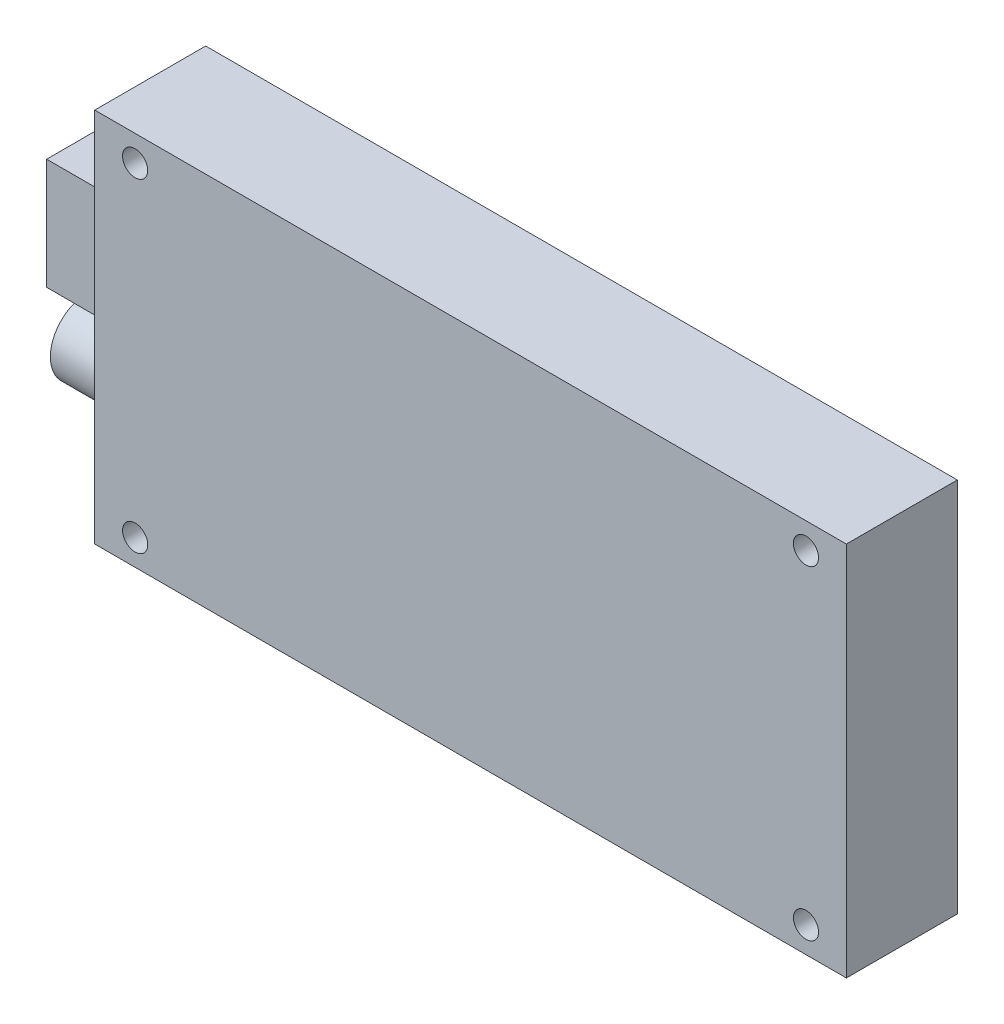
ISO-10303-21;
HEADER;
FILE_DESCRIPTION(('STEP AP214'),'2;1');
FILE_NAME('part.step','',(''),(''),'','','');
FILE_SCHEMA(('AUTOMOTIVE_DESIGN { 1 0 10303 214 1 1 1 1 }'));
ENDSEC;
DATA;
#1=APPLICATION_CONTEXT('core data for automotive mechanical design processes');
#2=APPLICATION_PROTOCOL_DEFINITION('international standard','automotive_design',2000,#1);
#3=PRODUCT_CONTEXT('',#1,'mechanical');
#4=PRODUCT('Part','Part','',(#3));
#5=PRODUCT_RELATED_PRODUCT_CATEGORY('part','',(#4));
#6=PRODUCT_DEFINITION_FORMATION('','',#4);
#7=PRODUCT_DEFINITION_CONTEXT('part definition',#1,'design');
#8=PRODUCT_DEFINITION('design','',#6,#7);
#9=PRODUCT_DEFINITION_SHAPE('','',#8);
#10=(LENGTH_UNIT() NAMED_UNIT(*) SI_UNIT(.MILLI.,.METRE.));
#11=(NAMED_UNIT(*) PLANE_ANGLE_UNIT() SI_UNIT($,.RADIAN.));
#12=(NAMED_UNIT(*) SI_UNIT($,.STERADIAN.) SOLID_ANGLE_UNIT());
#13=UNCERTAINTY_MEASURE_WITH_UNIT(LENGTH_MEASURE(1.E-05),#10,'distance_accuracy_value','');
#14=(GEOMETRIC_REPRESENTATION_CONTEXT(3) GLOBAL_UNCERTAINTY_ASSIGNED_CONTEXT((#13)) GLOBAL_UNIT_ASSIGNED_CONTEXT((#10,
#11,#12)) REPRESENTATION_CONTEXT('',''));
#15=CARTESIAN_POINT('',(0.,0.,0.));
#16=DIRECTION('',(0.,0.,1.));
#17=DIRECTION('',(1.,0.,0.));
#18=AXIS2_PLACEMENT_3D('',#15,#16,#17);
#19=CARTESIAN_POINT('',(-50.8,-2.1,11.5));
#20=DIRECTION('',(0.,0.,1.));
#21=DIRECTION('',(0.,-1.,0.));
#22=AXIS2_PLACEMENT_3D('',#19,#20,#21);
#23=PLANE('',#22);
#24=DIRECTION('',(0.,-1.,0.));
#25=VECTOR('',#24,1.);
#26=CARTESIAN_POINT('',(-50.8,11.65,11.5));
#27=LINE('',#26,#25);
#28=CARTESIAN_POINT('',(-50.8,12.9,11.5));
#29=VERTEX_POINT('',#28);
#30=CARTESIAN_POINT('',(-50.8,-2.1,11.5));
#31=VERTEX_POINT('',#30);
#32=EDGE_CURVE('E33',#29,#31,#27,.T.);
#33=ORIENTED_EDGE('',*,*,#32,.F.);
#34=DIRECTION('',(-1.,0.,0.));
#35=VECTOR('',#34,1.);
#36=CARTESIAN_POINT('',(-50.8,12.9,11.5));
#37=LINE('',#36,#35);
#38=CARTESIAN_POINT('',(-60.8,12.9,11.5));
#39=VERTEX_POINT('',#38);
#40=EDGE_CURVE('E9',#29,#39,#37,.T.);
#41=ORIENTED_EDGE('',*,*,#40,.T.);
#42=DIRECTION('',(0.,1.,0.));
#43=VECTOR('',#42,1.);
#44=CARTESIAN_POINT('',(-60.8,12.9,11.5));
#45=LINE('',#44,#43);
#46=CARTESIAN_POINT('',(-60.8,-2.1,11.5));
#47=VERTEX_POINT('',#46);
#48=EDGE_CURVE('E159',#47,#39,#45,.T.);
#49=ORIENTED_EDGE('',*,*,#48,.F.);
#50=DIRECTION('',(-1.,0.,0.));
#51=VECTOR('',#50,1.);
#52=CARTESIAN_POINT('',(-50.8,-2.1,11.5));
#53=LINE('',#52,#51);
#54=EDGE_CURVE('E25',#31,#47,#53,.T.);
#55=ORIENTED_EDGE('',*,*,#54,.F.);
#56=EDGE_LOOP('',(#33,#41,#49,#55));
#57=FACE_BOUND('',#56,.T.);
#58=ADVANCED_FACE('F15',(#57),#23,.T.);
#59=CARTESIAN_POINT('',(-50.8,-2.1,-3.49999999999999));
#60=DIRECTION('',(0.,-1.,0.));
#61=DIRECTION('',(0.,0.,-1.));
#62=AXIS2_PLACEMENT_3D('',#59,#60,#61);
#63=PLANE('',#62);
#64=DIRECTION('',(0.,0.,-1.));
#65=VECTOR('',#64,1.);
#66=CARTESIAN_POINT('',(-50.8,-2.1,-1.75));
#67=LINE('',#66,#65);
#68=CARTESIAN_POINT('',(-50.8,-2.1,0.));
#69=VERTEX_POINT('',#68);
#70=EDGE_CURVE('E122',#31,#69,#67,.T.);
#71=ORIENTED_EDGE('',*,*,#70,.F.);
#72=ORIENTED_EDGE('',*,*,#54,.T.);
#73=DIRECTION('',(0.,0.,1.));
#74=VECTOR('',#73,1.);
#75=CARTESIAN_POINT('',(-60.8,-2.1,11.5));
#76=LINE('',#75,#74);
#77=CARTESIAN_POINT('',(-60.8,-2.1,-3.49999999999999));
#78=VERTEX_POINT('',#77);
#79=EDGE_CURVE('E162',#78,#47,#76,.T.);
#80=ORIENTED_EDGE('',*,*,#79,.F.);
#81=DIRECTION('',(-1.,0.,0.));
#82=VECTOR('',#81,1.);
#83=CARTESIAN_POINT('',(-50.8,-2.1,-3.49999999999999));
#84=LINE('',#83,#82);
#85=CARTESIAN_POINT('',(-50.8,-2.1,-3.49999999999999));
#86=VERTEX_POINT('',#85);
#87=EDGE_CURVE('E386',#86,#78,#84,.T.);
#88=ORIENTED_EDGE('',*,*,#87,.F.);
#89=DIRECTION('',(0.,0.,-1.));
#90=VECTOR('',#89,1.);
#91=CARTESIAN_POINT('',(-50.8,-2.1,11.5));
#92=LINE('',#91,#90);
#93=EDGE_CURVE('E160',#69,#86,#92,.T.);
#94=ORIENTED_EDGE('',*,*,#93,.F.);
#95=EDGE_LOOP('',(#71,#72,#80,#88,#94));
#96=FACE_BOUND('',#95,.T.);
#97=ADVANCED_FACE('F207',(#96),#63,.T.);
#98=CARTESIAN_POINT('',(-50.8,12.9,-3.5));
#99=DIRECTION('',(0.,0.,-1.));
#100=DIRECTION('',(0.,1.,0.));
#101=AXIS2_PLACEMENT_3D('',#98,#99,#100);
#102=PLANE('',#101);
#103=DIRECTION('',(0.,1.,0.));
#104=VECTOR('',#103,1.);
#105=CARTESIAN_POINT('',(-50.8,-2.1,-3.49999999999999));
#106=LINE('',#105,#104);
#107=CARTESIAN_POINT('',(-50.8,12.9,-3.5));
#108=VERTEX_POINT('',#107);
#109=EDGE_CURVE('E164',#86,#108,#106,.T.);
#110=ORIENTED_EDGE('',*,*,#109,.F.);
#111=ORIENTED_EDGE('',*,*,#87,.T.);
#112=DIRECTION('',(0.,-1.,0.));
#113=VECTOR('',#112,1.);
#114=CARTESIAN_POINT('',(-60.8,-2.1,-3.49999999999999));
#115=LINE('',#114,#113);
#116=CARTESIAN_POINT('',(-60.8,12.9,-3.5));
#117=VERTEX_POINT('',#116);
#118=EDGE_CURVE('E383',#117,#78,#115,.T.);
#119=ORIENTED_EDGE('',*,*,#118,.F.);
#120=DIRECTION('',(-1.,0.,0.));
#121=VECTOR('',#120,1.);
#122=CARTESIAN_POINT('',(-50.8,12.9,-3.5));
#123=LINE('',#122,#121);
#124=EDGE_CURVE('E385',#108,#117,#123,.T.);
#125=ORIENTED_EDGE('',*,*,#124,.F.);
#126=EDGE_LOOP('',(#110,#111,#119,#125));
#127=FACE_BOUND('',#126,.T.);
#128=ADVANCED_FACE('F212',(#127),#102,.T.);
#129=CARTESIAN_POINT('',(-50.8,12.9,11.5));
#130=DIRECTION('',(0.,1.,0.));
#131=DIRECTION('',(0.,0.,1.));
#132=AXIS2_PLACEMENT_3D('',#129,#130,#131);
#133=PLANE('',#132);
#134=DIRECTION('',(0.,0.,1.));
#135=VECTOR('',#134,1.);
#136=CARTESIAN_POINT('',(-50.8,12.9,-3.5));
#137=LINE('',#136,#135);
#138=CARTESIAN_POINT('',(-50.8,12.9,0.));
#139=VERTEX_POINT('',#138);
#140=EDGE_CURVE('E172',#108,#139,#137,.T.);
#141=ORIENTED_EDGE('',*,*,#140,.F.);
#142=ORIENTED_EDGE('',*,*,#124,.T.);
#143=DIRECTION('',(0.,0.,-1.));
#144=VECTOR('',#143,1.);
#145=CARTESIAN_POINT('',(-60.8,12.9,-3.5));
#146=LINE('',#145,#144);
#147=EDGE_CURVE('E381',#39,#117,#146,.T.);
#148=ORIENTED_EDGE('',*,*,#147,.F.);
#149=ORIENTED_EDGE('',*,*,#40,.F.);
#150=DIRECTION('',(0.,0.,1.));
#151=VECTOR('',#150,1.);
#152=CARTESIAN_POINT('',(-50.8,12.9,5.75));
#153=LINE('',#152,#151);
#154=EDGE_CURVE('E135',#139,#29,#153,.T.);
#155=ORIENTED_EDGE('',*,*,#154,.F.);
#156=EDGE_LOOP('',(#141,#142,#148,#149,#155));
#157=FACE_BOUND('',#156,.T.);
#158=ADVANCED_FACE('F218',(#157),#133,.T.);
#159=CARTESIAN_POINT('',(-60.8,5.4,4.));
#160=DIRECTION('',(1.,0.,0.));
#161=DIRECTION('',(0.,0.,-1.));
#162=AXIS2_PLACEMENT_3D('',#159,#160,#161);
#163=PLANE('',#162);
#164=ORIENTED_EDGE('',*,*,#147,.T.);
#165=ORIENTED_EDGE('',*,*,#118,.T.);
#166=ORIENTED_EDGE('',*,*,#79,.T.);
#167=ORIENTED_EDGE('',*,*,#48,.T.);
#168=EDGE_LOOP('',(#164,#165,#166,#167));
#169=FACE_BOUND('',#168,.T.);
#170=ADVANCED_FACE('F222',(#169),#163,.F.);
#171=CARTESIAN_POINT('',(-50.8,5.4,4.));
#172=DIRECTION('',(1.,0.,0.));
#173=DIRECTION('',(0.,0.,-1.));
#174=AXIS2_PLACEMENT_3D('',#171,#172,#173);
#175=PLANE('',#174);
#176=DIRECTION('',(0.,-1.,0.));
#177=VECTOR('',#176,1.);
#178=CARTESIAN_POINT('',(-50.8,25.4,0.));
#179=LINE('',#178,#177);
#180=EDGE_CURVE('E156',#139,#69,#179,.T.);
#181=ORIENTED_EDGE('',*,*,#180,.T.);
#182=ORIENTED_EDGE('',*,*,#93,.T.);
#183=ORIENTED_EDGE('',*,*,#109,.T.);
#184=ORIENTED_EDGE('',*,*,#140,.T.);
#185=EDGE_LOOP('',(#181,#182,#183,#184));
#186=FACE_BOUND('',#185,.T.);
#187=ADVANCED_FACE('F226',(#186),#175,.T.);
#188=CARTESIAN_POINT('',(-50.8,-10.5,6.));
#189=DIRECTION('',(-1.,0.,0.));
#190=DIRECTION('',(0.,0.,1.));
#191=AXIS2_PLACEMENT_3D('',#188,#189,#190);
#192=CYLINDRICAL_SURFACE('',#191,5.);
#193=CARTESIAN_POINT('',(-60.8,-10.5,6.));
#194=DIRECTION('',(-1.,0.,0.));
#195=DIRECTION('',(0.,0.,1.));
#196=AXIS2_PLACEMENT_3D('',#193,#194,#195);
#197=CIRCLE('',#196,5.);
#198=CARTESIAN_POINT('',(-60.8,-10.5,11.));
#199=VERTEX_POINT('',#198);
#200=EDGE_CURVE('E169',#199,#199,#197,.T.);
#201=ORIENTED_EDGE('',*,*,#200,.F.);
#202=EDGE_LOOP('',(#201));
#203=FACE_BOUND('',#202,.T.);
#204=CARTESIAN_POINT('',(-50.8,-10.5,6.));
#205=DIRECTION('',(1.,0.,0.));
#206=DIRECTION('',(0.,1.,0.));
#207=AXIS2_PLACEMENT_3D('',#204,#205,#206);
#208=CIRCLE('',#207,5.);
#209=CARTESIAN_POINT('',(-50.8,-5.5,6.));
#210=VERTEX_POINT('',#209);
#211=EDGE_CURVE('E138',#210,#210,#208,.T.);
#212=ORIENTED_EDGE('',*,*,#211,.F.);
#213=EDGE_LOOP('',(#212));
#214=FACE_BOUND('',#213,.T.);
#215=ADVANCED_FACE('F17',(#203,#214),#192,.T.);
#216=CARTESIAN_POINT('',(-60.8,-10.5,6.));
#217=DIRECTION('',(1.,0.,0.));
#218=DIRECTION('',(0.,0.,-1.));
#219=AXIS2_PLACEMENT_3D('',#216,#217,#218);
#220=PLANE('',#219);
#221=ORIENTED_EDGE('',*,*,#200,.T.);
#222=EDGE_LOOP('',(#221));
#223=FACE_BOUND('',#222,.T.);
#224=ADVANCED_FACE('F230',(#223),#220,.F.);
#225=CARTESIAN_POINT('',(45.339,-21.9075,-99.5783574677173));
#226=DIRECTION('',(0.,0.,1.));
#227=DIRECTION('',(1.,0.,0.));
#228=AXIS2_PLACEMENT_3D('',#225,#226,#227);
#229=CYLINDRICAL_SURFACE('',#228,1.7);
#230=CARTESIAN_POINT('',(45.339,-21.9075,0.));
#231=DIRECTION('',(0.,0.,1.));
#232=DIRECTION('',(1.,0.,0.));
#233=AXIS2_PLACEMENT_3D('',#230,#231,#232);
#234=CIRCLE('',#233,1.7);
#235=CARTESIAN_POINT('',(47.039,-21.9075,0.));
#236=VERTEX_POINT('',#235);
#237=EDGE_CURVE('E127',#236,#236,#234,.T.);
#238=ORIENTED_EDGE('',*,*,#237,.F.);
#239=EDGE_LOOP('',(#238));
#240=FACE_BOUND('',#239,.T.);
#241=CARTESIAN_POINT('',(45.339,-21.9075,15.));
#242=DIRECTION('',(0.,0.,-1.));
#243=DIRECTION('',(0.,-1.,0.));
#244=AXIS2_PLACEMENT_3D('',#241,#242,#243);
#245=CIRCLE('',#244,1.7);
#246=CARTESIAN_POINT('',(45.339,-23.6075,15.));
#247=VERTEX_POINT('',#246);
#248=EDGE_CURVE('E102',#247,#247,#245,.T.);
#249=ORIENTED_EDGE('',*,*,#248,.F.);
#250=EDGE_LOOP('',(#249));
#251=FACE_BOUND('',#250,.T.);
#252=ADVANCED_FACE('F233',(#240,#251),#229,.F.);
#253=CARTESIAN_POINT('',(-45.339,21.9075,-99.5783574677173));
#254=DIRECTION('',(0.,0.,1.));
#255=DIRECTION('',(1.,0.,0.));
#256=AXIS2_PLACEMENT_3D('',#253,#254,#255);
#257=CYLINDRICAL_SURFACE('',#256,1.7);
#258=CARTESIAN_POINT('',(-45.339,21.9075,0.));
#259=DIRECTION('',(0.,0.,1.));
#260=DIRECTION('',(1.,0.,0.));
#261=AXIS2_PLACEMENT_3D('',#258,#259,#260);
#262=CIRCLE('',#261,1.7);
#263=CARTESIAN_POINT('',(-43.639,21.9075,0.));
#264=VERTEX_POINT('',#263);
#265=EDGE_CURVE('E177',#264,#264,#262,.T.);
#266=ORIENTED_EDGE('',*,*,#265,.F.);
#267=EDGE_LOOP('',(#266));
#268=FACE_BOUND('',#267,.T.);
#269=CARTESIAN_POINT('',(-45.339,21.9075,15.));
#270=DIRECTION('',(0.,0.,-1.));
#271=DIRECTION('',(0.,-1.,0.));
#272=AXIS2_PLACEMENT_3D('',#269,#270,#271);
#273=CIRCLE('',#272,1.7);
#274=CARTESIAN_POINT('',(-45.339,20.2075,15.));
#275=VERTEX_POINT('',#274);
#276=EDGE_CURVE('E114',#275,#275,#273,.T.);
#277=ORIENTED_EDGE('',*,*,#276,.F.);
#278=EDGE_LOOP('',(#277));
#279=FACE_BOUND('',#278,.T.);
#280=ADVANCED_FACE('F203',(#268,#279),#257,.F.);
#281=CARTESIAN_POINT('',(45.339,21.9075,-99.5783574677173));
#282=DIRECTION('',(0.,0.,1.));
#283=DIRECTION('',(1.,0.,0.));
#284=AXIS2_PLACEMENT_3D('',#281,#282,#283);
#285=CYLINDRICAL_SURFACE('',#284,1.7);
#286=CARTESIAN_POINT('',(45.339,21.9075,0.));
#287=DIRECTION('',(0.,0.,1.));
#288=DIRECTION('',(1.,0.,0.));
#289=AXIS2_PLACEMENT_3D('',#286,#287,#288);
#290=CIRCLE('',#289,1.7);
#291=CARTESIAN_POINT('',(47.039,21.9075,0.));
#292=VERTEX_POINT('',#291);
#293=EDGE_CURVE('E182',#292,#292,#290,.T.);
#294=ORIENTED_EDGE('',*,*,#293,.F.);
#295=EDGE_LOOP('',(#294));
#296=FACE_BOUND('',#295,.T.);
#297=CARTESIAN_POINT('',(45.339,21.9075,15.));
#298=DIRECTION('',(0.,0.,-1.));
#299=DIRECTION('',(0.,-1.,0.));
#300=AXIS2_PLACEMENT_3D('',#297,#298,#299);
#301=CIRCLE('',#300,1.7);
#302=CARTESIAN_POINT('',(45.339,20.2075,15.));
#303=VERTEX_POINT('',#302);
#304=EDGE_CURVE('E109',#303,#303,#301,.T.);
#305=ORIENTED_EDGE('',*,*,#304,.F.);
#306=EDGE_LOOP('',(#305));
#307=FACE_BOUND('',#306,.T.);
#308=ADVANCED_FACE('F195',(#296,#307),#285,.F.);
#309=CARTESIAN_POINT('',(-45.339,-21.9075,-99.5783574677173));
#310=DIRECTION('',(0.,0.,1.));
#311=DIRECTION('',(1.,0.,0.));
#312=AXIS2_PLACEMENT_3D('',#309,#310,#311);
#313=CYLINDRICAL_SURFACE('',#312,1.7);
#314=CARTESIAN_POINT('',(-45.339,-21.9075,0.));
#315=DIRECTION('',(0.,0.,1.));
#316=DIRECTION('',(1.,0.,0.));
#317=AXIS2_PLACEMENT_3D('',#314,#315,#316);
#318=CIRCLE('',#317,1.7);
#319=CARTESIAN_POINT('',(-43.639,-21.9075,0.));
#320=VERTEX_POINT('',#319);
#321=EDGE_CURVE('E118',#320,#320,#318,.T.);
#322=ORIENTED_EDGE('',*,*,#321,.F.);
#323=EDGE_LOOP('',(#322));
#324=FACE_BOUND('',#323,.T.);
#325=CARTESIAN_POINT('',(-45.339,-21.9075,15.));
#326=DIRECTION('',(0.,0.,-1.));
#327=DIRECTION('',(0.,-1.,0.));
#328=AXIS2_PLACEMENT_3D('',#325,#326,#327);
#329=CIRCLE('',#328,1.7);
#330=CARTESIAN_POINT('',(-45.339,-23.6075,15.));
#331=VERTEX_POINT('',#330);
#332=EDGE_CURVE('E107',#331,#331,#329,.T.);
#333=ORIENTED_EDGE('',*,*,#332,.F.);
#334=EDGE_LOOP('',(#333));
#335=FACE_BOUND('',#334,.T.);
#336=ADVANCED_FACE('F192',(#324,#335),#313,.F.);
#337=CARTESIAN_POINT('',(-50.8,25.4,0.));
#338=DIRECTION('',(-1.,0.,0.));
#339=DIRECTION('',(0.,0.,1.));
#340=AXIS2_PLACEMENT_3D('',#337,#338,#339);
#341=PLANE('',#340);
#342=ORIENTED_EDGE('',*,*,#70,.T.);
#343=DIRECTION('',(0.,-1.,0.));
#344=VECTOR('',#343,1.);
#345=CARTESIAN_POINT('',(-50.8,25.4,0.));
#346=LINE('',#345,#344);
#347=CARTESIAN_POINT('',(-50.8,-25.4,0.));
#348=VERTEX_POINT('',#347);
#349=EDGE_CURVE('E119',#69,#348,#346,.T.);
#350=ORIENTED_EDGE('',*,*,#349,.T.);
#351=DIRECTION('',(0.,0.,1.));
#352=VECTOR('',#351,1.);
#353=CARTESIAN_POINT('',(-50.8,-25.4,0.));
#354=LINE('',#353,#352);
#355=CARTESIAN_POINT('',(-50.8,-25.4,15.));
#356=VERTEX_POINT('',#355);
#357=EDGE_CURVE('E123',#348,#356,#354,.T.);
#358=ORIENTED_EDGE('',*,*,#357,.T.);
#359=DIRECTION('',(0.,-1.,0.));
#360=VECTOR('',#359,1.);
#361=CARTESIAN_POINT('',(-50.8,25.4,15.));
#362=LINE('',#361,#360);
#363=CARTESIAN_POINT('',(-50.8,25.4,15.));
#364=VERTEX_POINT('',#363);
#365=EDGE_CURVE('E105',#364,#356,#362,.T.);
#366=ORIENTED_EDGE('',*,*,#365,.F.);
#367=DIRECTION('',(0.,0.,1.));
#368=VECTOR('',#367,1.);
#369=CARTESIAN_POINT('',(-50.8,25.4,0.));
#370=LINE('',#369,#368);
#371=CARTESIAN_POINT('',(-50.8,25.4,0.));
#372=VERTEX_POINT('',#371);
#373=EDGE_CURVE('E128',#372,#364,#370,.T.);
#374=ORIENTED_EDGE('',*,*,#373,.F.);
#375=DIRECTION('',(0.,-1.,0.));
#376=VECTOR('',#375,1.);
#377=CARTESIAN_POINT('',(-50.8,25.4,0.));
#378=LINE('',#377,#376);
#379=EDGE_CURVE('E125',#372,#139,#378,.T.);
#380=ORIENTED_EDGE('',*,*,#379,.T.);
#381=ORIENTED_EDGE('',*,*,#154,.T.);
#382=ORIENTED_EDGE('',*,*,#32,.T.);
#383=EDGE_LOOP('',(#342,#350,#358,#366,#374,#380,#381,#382));
#384=FACE_BOUND('',#383,.T.);
#385=ORIENTED_EDGE('',*,*,#211,.T.);
#386=EDGE_LOOP('',(#385));
#387=FACE_BOUND('',#386,.T.);
#388=ADVANCED_FACE('F150',(#384,#387),#341,.T.);
#389=CARTESIAN_POINT('',(50.8,25.4,0.));
#390=DIRECTION('',(0.,1.,0.));
#391=DIRECTION('',(0.,0.,1.));
#392=AXIS2_PLACEMENT_3D('',#389,#390,#391);
#393=PLANE('',#392);
#394=DIRECTION('',(-1.,0.,0.));
#395=VECTOR('',#394,1.);
#396=CARTESIAN_POINT('',(50.8,25.4,0.));
#397=LINE('',#396,#395);
#398=CARTESIAN_POINT('',(50.8,25.4,0.));
#399=VERTEX_POINT('',#398);
#400=EDGE_CURVE('E131',#399,#372,#397,.T.);
#401=ORIENTED_EDGE('',*,*,#400,.T.);
#402=ORIENTED_EDGE('',*,*,#373,.T.);
#403=DIRECTION('',(-1.,0.,0.));
#404=VECTOR('',#403,1.);
#405=CARTESIAN_POINT('',(50.8,25.4,15.));
#406=LINE('',#405,#404);
#407=CARTESIAN_POINT('',(50.8,25.4,15.));
#408=VERTEX_POINT('',#407);
#409=EDGE_CURVE('E94',#408,#364,#406,.T.);
#410=ORIENTED_EDGE('',*,*,#409,.F.);
#411=DIRECTION('',(0.,0.,1.));
#412=VECTOR('',#411,1.);
#413=CARTESIAN_POINT('',(50.8,25.4,0.));
#414=LINE('',#413,#412);
#415=EDGE_CURVE('E90',#399,#408,#414,.T.);
#416=ORIENTED_EDGE('',*,*,#415,.F.);
#417=EDGE_LOOP('',(#401,#402,#410,#416));
#418=FACE_BOUND('',#417,.T.);
#419=ADVANCED_FACE('F148',(#418),#393,.T.);
#420=CARTESIAN_POINT('',(50.8,-25.4,0.));
#421=DIRECTION('',(1.,0.,0.));
#422=DIRECTION('',(0.,0.,-1.));
#423=AXIS2_PLACEMENT_3D('',#420,#421,#422);
#424=PLANE('',#423);
#425=DIRECTION('',(0.,1.,0.));
#426=VECTOR('',#425,1.);
#427=CARTESIAN_POINT('',(50.8,-25.4,0.));
#428=LINE('',#427,#426);
#429=CARTESIAN_POINT('',(50.8,-25.4,0.));
#430=VERTEX_POINT('',#429);
#431=EDGE_CURVE('E132',#430,#399,#428,.T.);
#432=ORIENTED_EDGE('',*,*,#431,.T.);
#433=ORIENTED_EDGE('',*,*,#415,.T.);
#434=DIRECTION('',(0.,1.,0.));
#435=VECTOR('',#434,1.);
#436=CARTESIAN_POINT('',(50.8,-25.4,15.));
#437=LINE('',#436,#435);
#438=CARTESIAN_POINT('',(50.8,-25.4,15.));
#439=VERTEX_POINT('',#438);
#440=EDGE_CURVE('E88',#439,#408,#437,.T.);
#441=ORIENTED_EDGE('',*,*,#440,.F.);
#442=DIRECTION('',(0.,0.,1.));
#443=VECTOR('',#442,1.);
#444=CARTESIAN_POINT('',(50.8,-25.4,0.));
#445=LINE('',#444,#443);
#446=EDGE_CURVE('E84',#430,#439,#445,.T.);
#447=ORIENTED_EDGE('',*,*,#446,.F.);
#448=EDGE_LOOP('',(#432,#433,#441,#447));
#449=FACE_BOUND('',#448,.T.);
#450=ADVANCED_FACE('F89',(#449),#424,.T.);
#451=CARTESIAN_POINT('',(-50.8,-25.4,0.));
#452=DIRECTION('',(0.,-1.,0.));
#453=DIRECTION('',(0.,0.,-1.));
#454=AXIS2_PLACEMENT_3D('',#451,#452,#453);
#455=PLANE('',#454);
#456=DIRECTION('',(1.,0.,0.));
#457=VECTOR('',#456,1.);
#458=CARTESIAN_POINT('',(-50.8,-25.4,0.));
#459=LINE('',#458,#457);
#460=EDGE_CURVE('E101',#348,#430,#459,.T.);
#461=ORIENTED_EDGE('',*,*,#460,.T.);
#462=ORIENTED_EDGE('',*,*,#446,.T.);
#463=DIRECTION('',(1.,0.,0.));
#464=VECTOR('',#463,1.);
#465=CARTESIAN_POINT('',(-50.8,-25.4,15.));
#466=LINE('',#465,#464);
#467=EDGE_CURVE('E19',#356,#439,#466,.T.);
#468=ORIENTED_EDGE('',*,*,#467,.F.);
#469=ORIENTED_EDGE('',*,*,#357,.F.);
#470=EDGE_LOOP('',(#461,#462,#468,#469));
#471=FACE_BOUND('',#470,.T.);
#472=ADVANCED_FACE('F99',(#471),#455,.T.);
#473=CARTESIAN_POINT('',(0.,0.,15.));
#474=DIRECTION('',(0.,0.,1.));
#475=DIRECTION('',(1.,0.,0.));
#476=AXIS2_PLACEMENT_3D('',#473,#474,#475);
#477=PLANE('',#476);
#478=ORIENTED_EDGE('',*,*,#248,.T.);
#479=EDGE_LOOP('',(#478));
#480=FACE_BOUND('',#479,.T.);
#481=ORIENTED_EDGE('',*,*,#276,.T.);
#482=EDGE_LOOP('',(#481));
#483=FACE_BOUND('',#482,.T.);
#484=ORIENTED_EDGE('',*,*,#304,.T.);
#485=EDGE_LOOP('',(#484));
#486=FACE_BOUND('',#485,.T.);
#487=ORIENTED_EDGE('',*,*,#332,.T.);
#488=EDGE_LOOP('',(#487));
#489=FACE_BOUND('',#488,.T.);
#490=ORIENTED_EDGE('',*,*,#467,.T.);
#491=ORIENTED_EDGE('',*,*,#440,.T.);
#492=ORIENTED_EDGE('',*,*,#409,.T.);
#493=ORIENTED_EDGE('',*,*,#365,.T.);
#494=EDGE_LOOP('',(#490,#491,#492,#493));
#495=FACE_BOUND('',#494,.T.);
#496=ADVANCED_FACE('F104',(#480,#483,#486,#489,#495),#477,.T.);
#497=CARTESIAN_POINT('',(0.,0.,0.));
#498=DIRECTION('',(0.,0.,1.));
#499=DIRECTION('',(1.,0.,0.));
#500=AXIS2_PLACEMENT_3D('',#497,#498,#499);
#501=PLANE('',#500);
#502=ORIENTED_EDGE('',*,*,#237,.T.);
#503=EDGE_LOOP('',(#502));
#504=FACE_BOUND('',#503,.T.);
#505=ORIENTED_EDGE('',*,*,#265,.T.);
#506=EDGE_LOOP('',(#505));
#507=FACE_BOUND('',#506,.T.);
#508=ORIENTED_EDGE('',*,*,#293,.T.);
#509=EDGE_LOOP('',(#508));
#510=FACE_BOUND('',#509,.T.);
#511=ORIENTED_EDGE('',*,*,#321,.T.);
#512=EDGE_LOOP('',(#511));
#513=FACE_BOUND('',#512,.T.);
#514=ORIENTED_EDGE('',*,*,#460,.F.);
#515=ORIENTED_EDGE('',*,*,#349,.F.);
#516=ORIENTED_EDGE('',*,*,#180,.F.);
#517=ORIENTED_EDGE('',*,*,#379,.F.);
#518=ORIENTED_EDGE('',*,*,#400,.F.);
#519=ORIENTED_EDGE('',*,*,#431,.F.);
#520=EDGE_LOOP('',(#514,#515,#516,#517,#518,#519));
#521=FACE_BOUND('',#520,.T.);
#522=ADVANCED_FACE('F143',(#504,#507,#510,#513,#521),#501,.F.);
#523=CLOSED_SHELL('',(#58,#97,#128,#158,#170,#187,#215,#224,#252,#280,#308,#336,#388,#419,#450,
#472,#496,#522));
#524=MANIFOLD_SOLID_BREP('B1',#523);
#525=ADVANCED_BREP_SHAPE_REPRESENTATION('',(#18,#524),#14);
#526=SHAPE_DEFINITION_REPRESENTATION(#9,#525);
ENDSEC;
END-ISO-10303-21;
